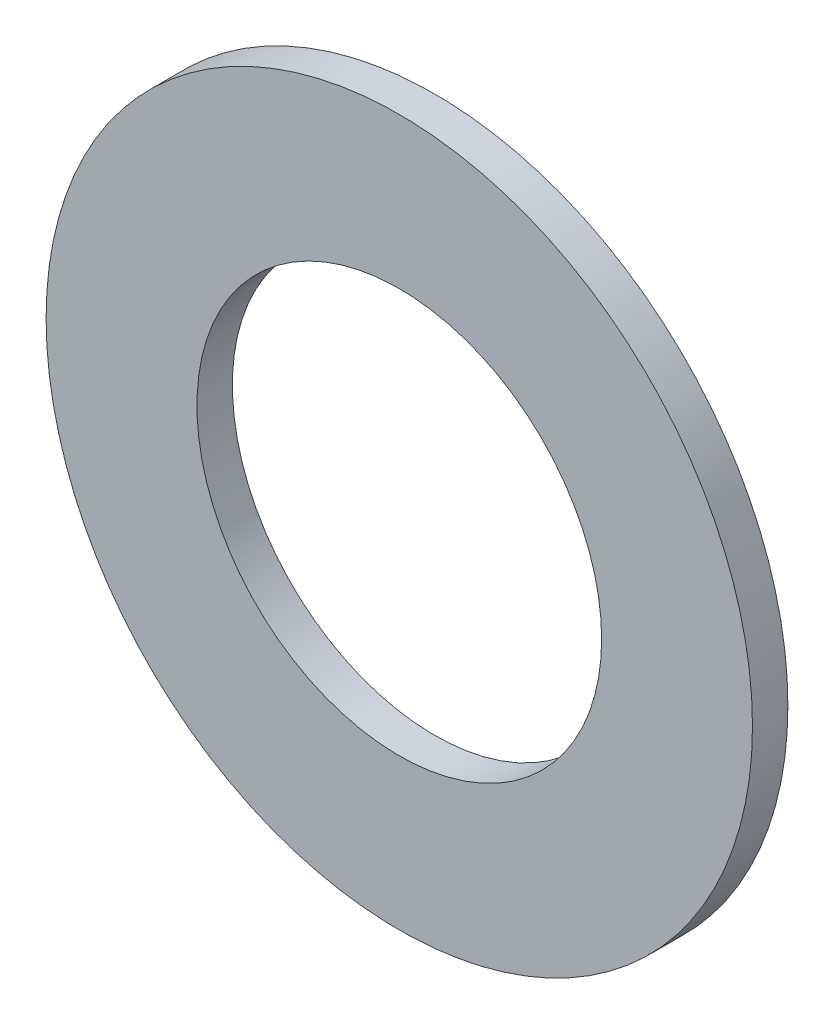
ISO-10303-21;
HEADER;
FILE_DESCRIPTION(('STEP AP214'),'2;1');
FILE_NAME('part.step','',(''),(''),'','','');
FILE_SCHEMA(('AUTOMOTIVE_DESIGN { 1 0 10303 214 1 1 1 1 }'));
ENDSEC;
DATA;
#1=APPLICATION_CONTEXT('core data for automotive mechanical design processes');
#2=APPLICATION_PROTOCOL_DEFINITION('international standard','automotive_design',2000,#1);
#3=PRODUCT_CONTEXT('',#1,'mechanical');
#4=PRODUCT('Part','Part','',(#3));
#5=PRODUCT_RELATED_PRODUCT_CATEGORY('part','',(#4));
#6=PRODUCT_DEFINITION_FORMATION('','',#4);
#7=PRODUCT_DEFINITION_CONTEXT('part definition',#1,'design');
#8=PRODUCT_DEFINITION('design','',#6,#7);
#9=PRODUCT_DEFINITION_SHAPE('','',#8);
#10=(LENGTH_UNIT() NAMED_UNIT(*) SI_UNIT(.MILLI.,.METRE.));
#11=(NAMED_UNIT(*) PLANE_ANGLE_UNIT() SI_UNIT($,.RADIAN.));
#12=(NAMED_UNIT(*) SI_UNIT($,.STERADIAN.) SOLID_ANGLE_UNIT());
#13=UNCERTAINTY_MEASURE_WITH_UNIT(LENGTH_MEASURE(1.E-05),#10,'distance_accuracy_value','');
#14=(GEOMETRIC_REPRESENTATION_CONTEXT(3) GLOBAL_UNCERTAINTY_ASSIGNED_CONTEXT((#13)) GLOBAL_UNIT_ASSIGNED_CONTEXT((#10,
#11,#12)) REPRESENTATION_CONTEXT('',''));
#15=CARTESIAN_POINT('',(0.,0.,0.));
#16=DIRECTION('',(0.,0.,1.));
#17=DIRECTION('',(1.,0.,0.));
#18=AXIS2_PLACEMENT_3D('',#15,#16,#17);
#19=CARTESIAN_POINT('',(0.,0.,0.));
#20=DIRECTION('',(0.,0.,-1.));
#21=DIRECTION('',(-1.,0.,0.));
#22=AXIS2_PLACEMENT_3D('',#19,#20,#21);
#23=PLANE('',#22);
#24=CARTESIAN_POINT('',(0.,0.,0.));
#25=DIRECTION('',(0.,0.,1.));
#26=DIRECTION('',(1.,0.,0.));
#27=AXIS2_PLACEMENT_3D('',#24,#25,#26);
#28=CIRCLE('',#27,6.82117);
#29=CARTESIAN_POINT('',(6.82117,0.,0.));
#30=VERTEX_POINT('',#29);
#31=EDGE_CURVE('E27',#30,#30,#28,.T.);
#32=ORIENTED_EDGE('',*,*,#31,.T.);
#33=EDGE_LOOP('',(#32));
#34=FACE_BOUND('',#33,.T.);
#35=CARTESIAN_POINT('',(0.,0.,0.));
#36=DIRECTION('',(0.,0.,1.));
#37=DIRECTION('',(1.,0.,0.));
#38=AXIS2_PLACEMENT_3D('',#35,#36,#37);
#39=CIRCLE('',#38,11.90625);
#40=CARTESIAN_POINT('',(11.90625,0.,0.));
#41=VERTEX_POINT('',#40);
#42=EDGE_CURVE('E18',#41,#41,#39,.T.);
#43=ORIENTED_EDGE('',*,*,#42,.F.);
#44=EDGE_LOOP('',(#43));
#45=FACE_BOUND('',#44,.T.);
#46=ADVANCED_FACE('F15',(#34,#45),#23,.T.);
#47=CARTESIAN_POINT('',(0.,0.,0.));
#48=DIRECTION('',(0.,0.,1.));
#49=DIRECTION('',(1.,0.,0.));
#50=AXIS2_PLACEMENT_3D('',#47,#48,#49);
#51=CYLINDRICAL_SURFACE('',#50,11.90625);
#52=ORIENTED_EDGE('',*,*,#42,.T.);
#53=EDGE_LOOP('',(#52));
#54=FACE_BOUND('',#53,.T.);
#55=CARTESIAN_POINT('',(0.,0.,1.1938));
#56=DIRECTION('',(0.,0.,1.));
#57=DIRECTION('',(1.,0.,0.));
#58=AXIS2_PLACEMENT_3D('',#55,#56,#57);
#59=CIRCLE('',#58,11.90625);
#60=CARTESIAN_POINT('',(11.90625,0.,1.1938));
#61=VERTEX_POINT('',#60);
#62=EDGE_CURVE('E22',#61,#61,#59,.F.);
#63=ORIENTED_EDGE('',*,*,#62,.T.);
#64=EDGE_LOOP('',(#63));
#65=FACE_BOUND('',#64,.T.);
#66=ADVANCED_FACE('F35',(#54,#65),#51,.T.);
#67=CARTESIAN_POINT('',(0.,0.,0.));
#68=DIRECTION('',(0.,0.,1.));
#69=DIRECTION('',(1.,0.,0.));
#70=AXIS2_PLACEMENT_3D('',#67,#68,#69);
#71=CYLINDRICAL_SURFACE('',#70,6.82117);
#72=ORIENTED_EDGE('',*,*,#31,.F.);
#73=EDGE_LOOP('',(#72));
#74=FACE_BOUND('',#73,.T.);
#75=CARTESIAN_POINT('',(0.,0.,1.1938));
#76=DIRECTION('',(0.,0.,1.));
#77=DIRECTION('',(1.,0.,0.));
#78=AXIS2_PLACEMENT_3D('',#75,#76,#77);
#79=CIRCLE('',#78,6.82117);
#80=CARTESIAN_POINT('',(6.82117,0.,1.1938));
#81=VERTEX_POINT('',#80);
#82=EDGE_CURVE('E10',#81,#81,#79,.T.);
#83=ORIENTED_EDGE('',*,*,#82,.T.);
#84=EDGE_LOOP('',(#83));
#85=FACE_BOUND('',#84,.T.);
#86=ADVANCED_FACE('F43',(#74,#85),#71,.F.);
#87=CARTESIAN_POINT('',(0.,0.,1.1938));
#88=DIRECTION('',(0.,0.,-1.));
#89=DIRECTION('',(-1.,0.,0.));
#90=AXIS2_PLACEMENT_3D('',#87,#88,#89);
#91=PLANE('',#90);
#92=ORIENTED_EDGE('',*,*,#82,.F.);
#93=EDGE_LOOP('',(#92));
#94=FACE_BOUND('',#93,.T.);
#95=ORIENTED_EDGE('',*,*,#62,.F.);
#96=EDGE_LOOP('',(#95));
#97=FACE_BOUND('',#96,.T.);
#98=ADVANCED_FACE('F44',(#94,#97),#91,.F.);
#99=CLOSED_SHELL('',(#46,#66,#86,#98));
#100=MANIFOLD_SOLID_BREP('B1',#99);
#101=ADVANCED_BREP_SHAPE_REPRESENTATION('',(#18,#100),#14);
#102=SHAPE_DEFINITION_REPRESENTATION(#9,#101);
ENDSEC;
END-ISO-10303-21;
